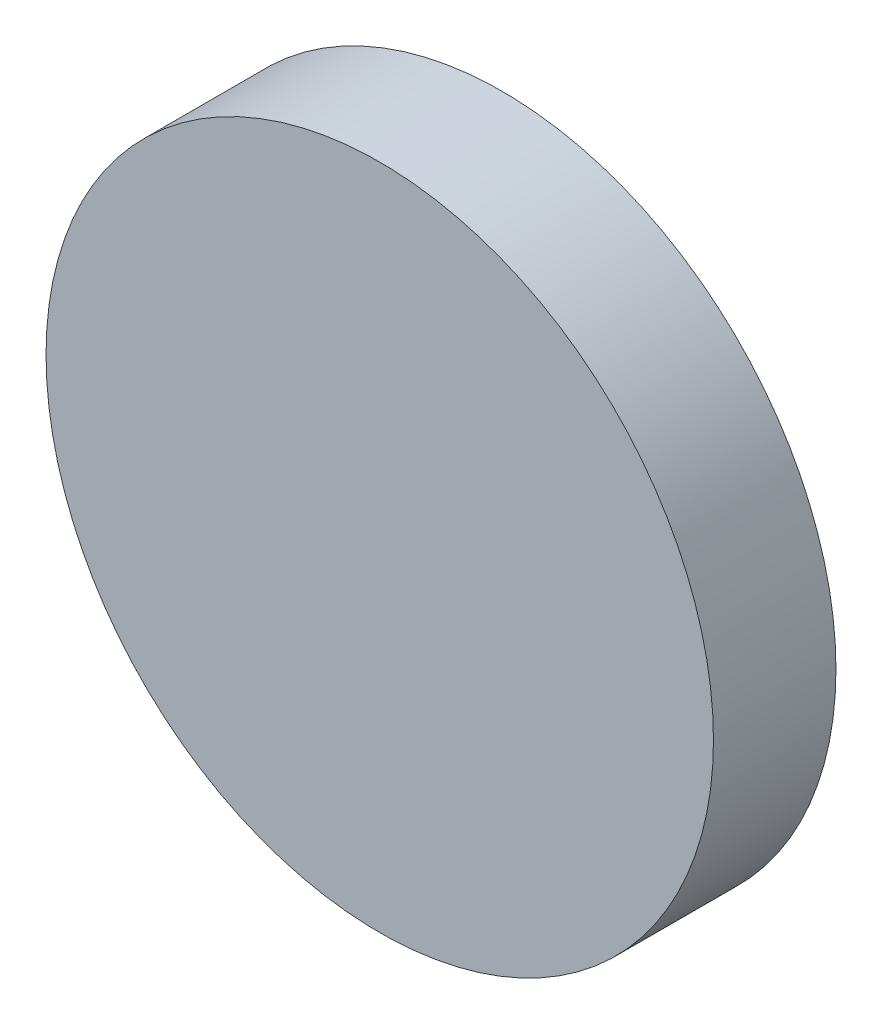
ISO-10303-21;
HEADER;
FILE_DESCRIPTION(('STEP AP214'),'2;1');
FILE_NAME('part.step','',(''),(''),'','','');
FILE_SCHEMA(('AUTOMOTIVE_DESIGN { 1 0 10303 214 1 1 1 1 }'));
ENDSEC;
DATA;
#1=APPLICATION_CONTEXT('core data for automotive mechanical design processes');
#2=APPLICATION_PROTOCOL_DEFINITION('international standard','automotive_design',2000,#1);
#3=PRODUCT_CONTEXT('',#1,'mechanical');
#4=PRODUCT('Part','Part','',(#3));
#5=PRODUCT_RELATED_PRODUCT_CATEGORY('part','',(#4));
#6=PRODUCT_DEFINITION_FORMATION('','',#4);
#7=PRODUCT_DEFINITION_CONTEXT('part definition',#1,'design');
#8=PRODUCT_DEFINITION('design','',#6,#7);
#9=PRODUCT_DEFINITION_SHAPE('','',#8);
#10=(LENGTH_UNIT() NAMED_UNIT(*) SI_UNIT(.MILLI.,.METRE.));
#11=(NAMED_UNIT(*) PLANE_ANGLE_UNIT() SI_UNIT($,.RADIAN.));
#12=(NAMED_UNIT(*) SI_UNIT($,.STERADIAN.) SOLID_ANGLE_UNIT());
#13=UNCERTAINTY_MEASURE_WITH_UNIT(LENGTH_MEASURE(1.E-05),#10,'distance_accuracy_value','');
#14=(GEOMETRIC_REPRESENTATION_CONTEXT(3) GLOBAL_UNCERTAINTY_ASSIGNED_CONTEXT((#13)) GLOBAL_UNIT_ASSIGNED_CONTEXT((#10,
#11,#12)) REPRESENTATION_CONTEXT('',''));
#15=CARTESIAN_POINT('',(0.,0.,0.));
#16=DIRECTION('',(0.,0.,1.));
#17=DIRECTION('',(1.,0.,0.));
#18=AXIS2_PLACEMENT_3D('',#15,#16,#17);
#19=CARTESIAN_POINT('',(0.,0.,49.));
#20=DIRECTION('',(0.,0.,-1.));
#21=DIRECTION('',(-1.,0.,0.));
#22=AXIS2_PLACEMENT_3D('',#19,#20,#21);
#23=CYLINDRICAL_SURFACE('',#22,133.5);
#24=CARTESIAN_POINT('',(0.,0.,49.));
#25=DIRECTION('',(0.,0.,1.));
#26=DIRECTION('',(1.,0.,0.));
#27=AXIS2_PLACEMENT_3D('',#24,#25,#26);
#28=CIRCLE('',#27,133.5);
#29=CARTESIAN_POINT('',(133.5,0.,49.));
#30=VERTEX_POINT('',#29);
#31=EDGE_CURVE('E10',#30,#30,#28,.T.);
#32=ORIENTED_EDGE('',*,*,#31,.F.);
#33=EDGE_LOOP('',(#32));
#34=FACE_BOUND('',#33,.T.);
#35=CARTESIAN_POINT('',(0.,0.,0.));
#36=DIRECTION('',(0.,0.,1.));
#37=DIRECTION('',(1.,0.,0.));
#38=AXIS2_PLACEMENT_3D('',#35,#36,#37);
#39=CIRCLE('',#38,133.5);
#40=CARTESIAN_POINT('',(133.5,0.,0.));
#41=VERTEX_POINT('',#40);
#42=EDGE_CURVE('E35',#41,#41,#39,.T.);
#43=ORIENTED_EDGE('',*,*,#42,.T.);
#44=EDGE_LOOP('',(#43));
#45=FACE_BOUND('',#44,.T.);
#46=ADVANCED_FACE('F32',(#34,#45),#23,.T.);
#47=CARTESIAN_POINT('',(0.,0.,49.));
#48=DIRECTION('',(0.,0.,1.));
#49=DIRECTION('',(1.,0.,0.));
#50=AXIS2_PLACEMENT_3D('',#47,#48,#49);
#51=PLANE('',#50);
#52=ORIENTED_EDGE('',*,*,#31,.T.);
#53=EDGE_LOOP('',(#52));
#54=FACE_BOUND('',#53,.T.);
#55=ADVANCED_FACE('F47',(#54),#51,.T.);
#56=CARTESIAN_POINT('',(0.,0.,0.));
#57=DIRECTION('',(0.,0.,1.));
#58=DIRECTION('',(1.,0.,0.));
#59=AXIS2_PLACEMENT_3D('',#56,#57,#58);
#60=PLANE('',#59);
#61=ORIENTED_EDGE('',*,*,#42,.F.);
#62=EDGE_LOOP('',(#61));
#63=FACE_BOUND('',#62,.T.);
#64=ADVANCED_FACE('F45',(#63),#60,.F.);
#65=CLOSED_SHELL('',(#46,#55,#64));
#66=MANIFOLD_SOLID_BREP('B2',#65);
#67=ADVANCED_BREP_SHAPE_REPRESENTATION('',(#18,#66),#14);
#68=SHAPE_DEFINITION_REPRESENTATION(#9,#67);
ENDSEC;
END-ISO-10303-21;
